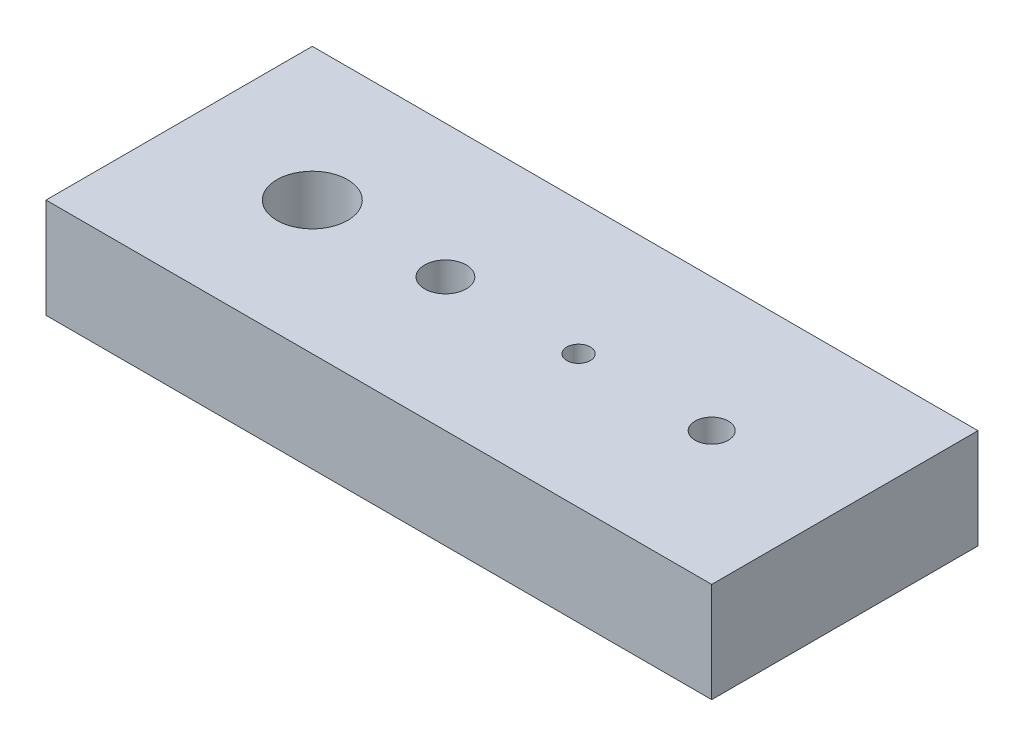
ISO-10303-21;
HEADER;
FILE_DESCRIPTION(('STEP AP214'),'2;1');
FILE_NAME('part.step','',(''),(''),'','','');
FILE_SCHEMA(('AUTOMOTIVE_DESIGN { 1 0 10303 214 1 1 1 1 }'));
ENDSEC;
DATA;
#1=APPLICATION_CONTEXT('core data for automotive mechanical design processes');
#2=APPLICATION_PROTOCOL_DEFINITION('international standard','automotive_design',2000,#1);
#3=PRODUCT_CONTEXT('',#1,'mechanical');
#4=PRODUCT('Part','Part','',(#3));
#5=PRODUCT_RELATED_PRODUCT_CATEGORY('part','',(#4));
#6=PRODUCT_DEFINITION_FORMATION('','',#4);
#7=PRODUCT_DEFINITION_CONTEXT('part definition',#1,'design');
#8=PRODUCT_DEFINITION('design','',#6,#7);
#9=PRODUCT_DEFINITION_SHAPE('','',#8);
#10=(LENGTH_UNIT() NAMED_UNIT(*) SI_UNIT(.MILLI.,.METRE.));
#11=(NAMED_UNIT(*) PLANE_ANGLE_UNIT() SI_UNIT($,.RADIAN.));
#12=(NAMED_UNIT(*) SI_UNIT($,.STERADIAN.) SOLID_ANGLE_UNIT());
#13=UNCERTAINTY_MEASURE_WITH_UNIT(LENGTH_MEASURE(1.E-05),#10,'distance_accuracy_value','');
#14=(GEOMETRIC_REPRESENTATION_CONTEXT(3) GLOBAL_UNCERTAINTY_ASSIGNED_CONTEXT((#13)) GLOBAL_UNIT_ASSIGNED_CONTEXT((#10,
#11,#12)) REPRESENTATION_CONTEXT('',''));
#15=CARTESIAN_POINT('',(0.,0.,0.));
#16=DIRECTION('',(0.,0.,1.));
#17=DIRECTION('',(1.,0.,0.));
#18=AXIS2_PLACEMENT_3D('',#15,#16,#17);
#19=CARTESIAN_POINT('',(0.,0.,50.8));
#20=DIRECTION('',(1.,0.,0.));
#21=DIRECTION('',(0.,0.,-1.));
#22=AXIS2_PLACEMENT_3D('',#19,#20,#21);
#23=PLANE('',#22);
#24=DIRECTION('',(0.,-1.,0.));
#25=VECTOR('',#24,1.);
#26=CARTESIAN_POINT('',(0.,0.,0.));
#27=LINE('',#26,#25);
#28=CARTESIAN_POINT('',(0.,19.05,0.));
#29=VERTEX_POINT('',#28);
#30=CARTESIAN_POINT('',(0.,0.,0.));
#31=VERTEX_POINT('',#30);
#32=EDGE_CURVE('E106',#29,#31,#27,.T.);
#33=ORIENTED_EDGE('',*,*,#32,.T.);
#34=DIRECTION('',(0.,0.,-1.));
#35=VECTOR('',#34,1.);
#36=CARTESIAN_POINT('',(0.,0.,50.8));
#37=LINE('',#36,#35);
#38=CARTESIAN_POINT('',(0.,0.,50.8));
#39=VERTEX_POINT('',#38);
#40=EDGE_CURVE('E11',#39,#31,#37,.T.);
#41=ORIENTED_EDGE('',*,*,#40,.F.);
#42=DIRECTION('',(0.,-1.,0.));
#43=VECTOR('',#42,1.);
#44=CARTESIAN_POINT('',(0.,0.,50.8));
#45=LINE('',#44,#43);
#46=CARTESIAN_POINT('',(0.,19.05,50.8));
#47=VERTEX_POINT('',#46);
#48=EDGE_CURVE('E94',#47,#39,#45,.T.);
#49=ORIENTED_EDGE('',*,*,#48,.F.);
#50=DIRECTION('',(0.,0.,-1.));
#51=VECTOR('',#50,1.);
#52=CARTESIAN_POINT('',(0.,19.05,50.8));
#53=LINE('',#52,#51);
#54=EDGE_CURVE('E102',#47,#29,#53,.T.);
#55=ORIENTED_EDGE('',*,*,#54,.T.);
#56=EDGE_LOOP('',(#33,#41,#49,#55));
#57=FACE_BOUND('',#56,.T.);
#58=ADVANCED_FACE('F43',(#57),#23,.F.);
#59=CARTESIAN_POINT('',(0.,0.,50.8));
#60=DIRECTION('',(0.,1.,0.));
#61=DIRECTION('',(0.,0.,1.));
#62=AXIS2_PLACEMENT_3D('',#59,#60,#61);
#63=PLANE('',#62);
#64=CARTESIAN_POINT('',(101.6,0.,25.4));
#65=DIRECTION('',(0.,1.,0.));
#66=DIRECTION('',(0.,0.,1.));
#67=AXIS2_PLACEMENT_3D('',#64,#65,#66);
#68=CIRCLE('',#67,3.175);
#69=CARTESIAN_POINT('',(101.6,0.,28.575));
#70=VERTEX_POINT('',#69);
#71=EDGE_CURVE('E137',#70,#70,#68,.T.);
#72=ORIENTED_EDGE('',*,*,#71,.T.);
#73=EDGE_LOOP('',(#72));
#74=FACE_BOUND('',#73,.T.);
#75=CARTESIAN_POINT('',(76.2,0.,25.4));
#76=DIRECTION('',(0.,1.,0.));
#77=DIRECTION('',(0.,0.,1.));
#78=AXIS2_PLACEMENT_3D('',#75,#76,#77);
#79=CIRCLE('',#78,2.2479);
#80=CARTESIAN_POINT('',(76.2,0.,27.6479));
#81=VERTEX_POINT('',#80);
#82=EDGE_CURVE('E131',#81,#81,#79,.T.);
#83=ORIENTED_EDGE('',*,*,#82,.T.);
#84=EDGE_LOOP('',(#83));
#85=FACE_BOUND('',#84,.T.);
#86=CARTESIAN_POINT('',(50.8,0.,25.4));
#87=DIRECTION('',(0.,1.,0.));
#88=DIRECTION('',(0.,0.,1.));
#89=AXIS2_PLACEMENT_3D('',#86,#87,#88);
#90=CIRCLE('',#89,3.96875);
#91=CARTESIAN_POINT('',(50.8,0.,29.36875));
#92=VERTEX_POINT('',#91);
#93=EDGE_CURVE('E125',#92,#92,#90,.T.);
#94=ORIENTED_EDGE('',*,*,#93,.T.);
#95=EDGE_LOOP('',(#94));
#96=FACE_BOUND('',#95,.T.);
#97=CARTESIAN_POINT('',(25.4,0.,25.4));
#98=DIRECTION('',(0.,1.,0.));
#99=DIRECTION('',(0.,0.,1.));
#100=AXIS2_PLACEMENT_3D('',#97,#98,#99);
#101=CIRCLE('',#100,6.74623999999999);
#102=CARTESIAN_POINT('',(25.4,0.,32.14624));
#103=VERTEX_POINT('',#102);
#104=EDGE_CURVE('E109',#103,#103,#101,.T.);
#105=ORIENTED_EDGE('',*,*,#104,.T.);
#106=EDGE_LOOP('',(#105));
#107=FACE_BOUND('',#106,.T.);
#108=DIRECTION('',(1.,0.,0.));
#109=VECTOR('',#108,1.);
#110=CARTESIAN_POINT('',(0.,0.,0.));
#111=LINE('',#110,#109);
#112=CARTESIAN_POINT('',(127.,0.,0.));
#113=VERTEX_POINT('',#112);
#114=EDGE_CURVE('E98',#31,#113,#111,.T.);
#115=ORIENTED_EDGE('',*,*,#114,.T.);
#116=DIRECTION('',(0.,0.,-1.));
#117=VECTOR('',#116,1.);
#118=CARTESIAN_POINT('',(127.,0.,50.8));
#119=LINE('',#118,#117);
#120=CARTESIAN_POINT('',(127.,0.,50.8));
#121=VERTEX_POINT('',#120);
#122=EDGE_CURVE('E51',#121,#113,#119,.T.);
#123=ORIENTED_EDGE('',*,*,#122,.F.);
#124=DIRECTION('',(1.,0.,0.));
#125=VECTOR('',#124,1.);
#126=CARTESIAN_POINT('',(0.,0.,50.8));
#127=LINE('',#126,#125);
#128=EDGE_CURVE('E89',#39,#121,#127,.T.);
#129=ORIENTED_EDGE('',*,*,#128,.F.);
#130=ORIENTED_EDGE('',*,*,#40,.T.);
#131=EDGE_LOOP('',(#115,#123,#129,#130));
#132=FACE_BOUND('',#131,.T.);
#133=ADVANCED_FACE('F97',(#74,#85,#96,#107,#132),#63,.F.);
#134=CARTESIAN_POINT('',(127.,0.,50.8));
#135=DIRECTION('',(-1.,0.,0.));
#136=DIRECTION('',(0.,0.,1.));
#137=AXIS2_PLACEMENT_3D('',#134,#135,#136);
#138=PLANE('',#137);
#139=DIRECTION('',(0.,1.,0.));
#140=VECTOR('',#139,1.);
#141=CARTESIAN_POINT('',(127.,0.,0.));
#142=LINE('',#141,#140);
#143=CARTESIAN_POINT('',(127.,19.05,0.));
#144=VERTEX_POINT('',#143);
#145=EDGE_CURVE('E76',#113,#144,#142,.T.);
#146=ORIENTED_EDGE('',*,*,#145,.T.);
#147=DIRECTION('',(0.,0.,-1.));
#148=VECTOR('',#147,1.);
#149=CARTESIAN_POINT('',(127.,19.05,50.8));
#150=LINE('',#149,#148);
#151=CARTESIAN_POINT('',(127.,19.05,50.8));
#152=VERTEX_POINT('',#151);
#153=EDGE_CURVE('E99',#152,#144,#150,.T.);
#154=ORIENTED_EDGE('',*,*,#153,.F.);
#155=DIRECTION('',(0.,1.,0.));
#156=VECTOR('',#155,1.);
#157=CARTESIAN_POINT('',(127.,0.,50.8));
#158=LINE('',#157,#156);
#159=EDGE_CURVE('E92',#121,#152,#158,.T.);
#160=ORIENTED_EDGE('',*,*,#159,.F.);
#161=ORIENTED_EDGE('',*,*,#122,.T.);
#162=EDGE_LOOP('',(#146,#154,#160,#161));
#163=FACE_BOUND('',#162,.T.);
#164=ADVANCED_FACE('F100',(#163),#138,.F.);
#165=CARTESIAN_POINT('',(0.,19.05,50.8));
#166=DIRECTION('',(0.,-1.,0.));
#167=DIRECTION('',(0.,0.,-1.));
#168=AXIS2_PLACEMENT_3D('',#165,#166,#167);
#169=PLANE('',#168);
#170=CARTESIAN_POINT('',(101.6,19.05,25.4));
#171=DIRECTION('',(0.,1.,0.));
#172=DIRECTION('',(0.,0.,1.));
#173=AXIS2_PLACEMENT_3D('',#170,#171,#172);
#174=CIRCLE('',#173,3.175);
#175=CARTESIAN_POINT('',(101.6,19.05,28.575));
#176=VERTEX_POINT('',#175);
#177=EDGE_CURVE('E140',#176,#176,#174,.T.);
#178=ORIENTED_EDGE('',*,*,#177,.F.);
#179=EDGE_LOOP('',(#178));
#180=FACE_BOUND('',#179,.T.);
#181=CARTESIAN_POINT('',(76.2,19.05,25.4));
#182=DIRECTION('',(0.,1.,0.));
#183=DIRECTION('',(0.,0.,1.));
#184=AXIS2_PLACEMENT_3D('',#181,#182,#183);
#185=CIRCLE('',#184,2.2479);
#186=CARTESIAN_POINT('',(76.2,19.05,27.6479));
#187=VERTEX_POINT('',#186);
#188=EDGE_CURVE('E134',#187,#187,#185,.T.);
#189=ORIENTED_EDGE('',*,*,#188,.F.);
#190=EDGE_LOOP('',(#189));
#191=FACE_BOUND('',#190,.T.);
#192=CARTESIAN_POINT('',(50.8,19.05,25.4));
#193=DIRECTION('',(0.,1.,0.));
#194=DIRECTION('',(0.,0.,1.));
#195=AXIS2_PLACEMENT_3D('',#192,#193,#194);
#196=CIRCLE('',#195,3.96875);
#197=CARTESIAN_POINT('',(50.8,19.05,29.36875));
#198=VERTEX_POINT('',#197);
#199=EDGE_CURVE('E128',#198,#198,#196,.T.);
#200=ORIENTED_EDGE('',*,*,#199,.F.);
#201=EDGE_LOOP('',(#200));
#202=FACE_BOUND('',#201,.T.);
#203=CARTESIAN_POINT('',(25.4,19.05,25.4));
#204=DIRECTION('',(0.,1.,0.));
#205=DIRECTION('',(0.,0.,1.));
#206=AXIS2_PLACEMENT_3D('',#203,#204,#205);
#207=CIRCLE('',#206,6.74624);
#208=CARTESIAN_POINT('',(25.4,19.05,32.14624));
#209=VERTEX_POINT('',#208);
#210=EDGE_CURVE('E122',#209,#209,#207,.T.);
#211=ORIENTED_EDGE('',*,*,#210,.F.);
#212=EDGE_LOOP('',(#211));
#213=FACE_BOUND('',#212,.T.);
#214=DIRECTION('',(-1.,0.,0.));
#215=VECTOR('',#214,1.);
#216=CARTESIAN_POINT('',(0.,19.05,0.));
#217=LINE('',#216,#215);
#218=EDGE_CURVE('E82',#144,#29,#217,.T.);
#219=ORIENTED_EDGE('',*,*,#218,.T.);
#220=ORIENTED_EDGE('',*,*,#54,.F.);
#221=DIRECTION('',(-1.,0.,0.));
#222=VECTOR('',#221,1.);
#223=CARTESIAN_POINT('',(0.,19.05,50.8));
#224=LINE('',#223,#222);
#225=EDGE_CURVE('E59',#152,#47,#224,.T.);
#226=ORIENTED_EDGE('',*,*,#225,.F.);
#227=ORIENTED_EDGE('',*,*,#153,.T.);
#228=EDGE_LOOP('',(#219,#220,#226,#227));
#229=FACE_BOUND('',#228,.T.);
#230=ADVANCED_FACE('F114',(#180,#191,#202,#213,#229),#169,.F.);
#231=CARTESIAN_POINT('',(0.,0.,50.8));
#232=DIRECTION('',(0.,0.,-1.));
#233=DIRECTION('',(-1.,0.,0.));
#234=AXIS2_PLACEMENT_3D('',#231,#232,#233);
#235=PLANE('',#234);
#236=ORIENTED_EDGE('',*,*,#48,.T.);
#237=ORIENTED_EDGE('',*,*,#128,.T.);
#238=ORIENTED_EDGE('',*,*,#159,.T.);
#239=ORIENTED_EDGE('',*,*,#225,.T.);
#240=EDGE_LOOP('',(#236,#237,#238,#239));
#241=FACE_BOUND('',#240,.T.);
#242=ADVANCED_FACE('F90',(#241),#235,.F.);
#243=CARTESIAN_POINT('',(0.,0.,0.));
#244=DIRECTION('',(0.,0.,-1.));
#245=DIRECTION('',(-1.,0.,0.));
#246=AXIS2_PLACEMENT_3D('',#243,#244,#245);
#247=PLANE('',#246);
#248=ORIENTED_EDGE('',*,*,#32,.F.);
#249=ORIENTED_EDGE('',*,*,#218,.F.);
#250=ORIENTED_EDGE('',*,*,#145,.F.);
#251=ORIENTED_EDGE('',*,*,#114,.F.);
#252=EDGE_LOOP('',(#248,#249,#250,#251));
#253=FACE_BOUND('',#252,.T.);
#254=ADVANCED_FACE('F117',(#253),#247,.T.);
#255=CARTESIAN_POINT('',(25.4,19.05,25.4));
#256=DIRECTION('',(0.,1.,0.));
#257=DIRECTION('',(0.,0.,1.));
#258=AXIS2_PLACEMENT_3D('',#255,#256,#257);
#259=CYLINDRICAL_SURFACE('',#258,6.74624);
#260=ORIENTED_EDGE('',*,*,#104,.F.);
#261=EDGE_LOOP('',(#260));
#262=FACE_BOUND('',#261,.T.);
#263=ORIENTED_EDGE('',*,*,#210,.T.);
#264=EDGE_LOOP('',(#263));
#265=FACE_BOUND('',#264,.T.);
#266=ADVANCED_FACE('F155',(#262,#265),#259,.F.);
#267=CARTESIAN_POINT('',(50.8,19.05,25.4));
#268=DIRECTION('',(0.,1.,0.));
#269=DIRECTION('',(0.,0.,1.));
#270=AXIS2_PLACEMENT_3D('',#267,#268,#269);
#271=CYLINDRICAL_SURFACE('',#270,3.96875);
#272=ORIENTED_EDGE('',*,*,#93,.F.);
#273=EDGE_LOOP('',(#272));
#274=FACE_BOUND('',#273,.T.);
#275=ORIENTED_EDGE('',*,*,#199,.T.);
#276=EDGE_LOOP('',(#275));
#277=FACE_BOUND('',#276,.T.);
#278=ADVANCED_FACE('F157',(#274,#277),#271,.F.);
#279=CARTESIAN_POINT('',(76.2,19.05,25.4));
#280=DIRECTION('',(0.,1.,0.));
#281=DIRECTION('',(0.,0.,1.));
#282=AXIS2_PLACEMENT_3D('',#279,#280,#281);
#283=CYLINDRICAL_SURFACE('',#282,2.2479);
#284=ORIENTED_EDGE('',*,*,#82,.F.);
#285=EDGE_LOOP('',(#284));
#286=FACE_BOUND('',#285,.T.);
#287=ORIENTED_EDGE('',*,*,#188,.T.);
#288=EDGE_LOOP('',(#287));
#289=FACE_BOUND('',#288,.T.);
#290=ADVANCED_FACE('F164',(#286,#289),#283,.F.);
#291=CARTESIAN_POINT('',(101.6,19.05,25.4));
#292=DIRECTION('',(0.,1.,0.));
#293=DIRECTION('',(0.,0.,1.));
#294=AXIS2_PLACEMENT_3D('',#291,#292,#293);
#295=CYLINDRICAL_SURFACE('',#294,3.175);
#296=ORIENTED_EDGE('',*,*,#71,.F.);
#297=EDGE_LOOP('',(#296));
#298=FACE_BOUND('',#297,.T.);
#299=ORIENTED_EDGE('',*,*,#177,.T.);
#300=EDGE_LOOP('',(#299));
#301=FACE_BOUND('',#300,.T.);
#302=ADVANCED_FACE('F144',(#298,#301),#295,.F.);
#303=CLOSED_SHELL('',(#58,#133,#164,#230,#242,#254,#266,#278,#290,#302));
#304=MANIFOLD_SOLID_BREP('B2',#303);
#305=ADVANCED_BREP_SHAPE_REPRESENTATION('',(#18,#304),#14);
#306=SHAPE_DEFINITION_REPRESENTATION(#9,#305);
ENDSEC;
END-ISO-10303-21;
